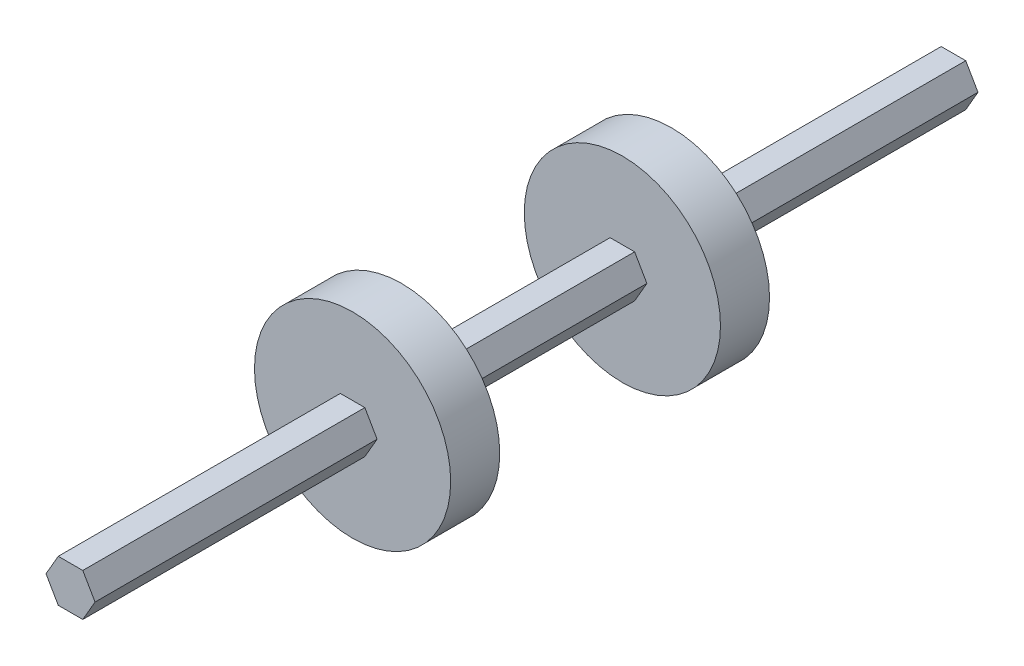
ISO-10303-21;
HEADER;
FILE_DESCRIPTION(('STEP AP214'),'2;1');
FILE_NAME('part.step','',(''),(''),'','','');
FILE_SCHEMA(('AUTOMOTIVE_DESIGN { 1 0 10303 214 1 1 1 1 }'));
ENDSEC;
DATA;
#1=APPLICATION_CONTEXT('core data for automotive mechanical design processes');
#2=APPLICATION_PROTOCOL_DEFINITION('international standard','automotive_design',2000,#1);
#3=PRODUCT_CONTEXT('',#1,'mechanical');
#4=PRODUCT('Part','Part','',(#3));
#5=PRODUCT_RELATED_PRODUCT_CATEGORY('part','',(#4));
#6=PRODUCT_DEFINITION_FORMATION('','',#4);
#7=PRODUCT_DEFINITION_CONTEXT('part definition',#1,'design');
#8=PRODUCT_DEFINITION('design','',#6,#7);
#9=PRODUCT_DEFINITION_SHAPE('','',#8);
#10=(LENGTH_UNIT() NAMED_UNIT(*) SI_UNIT(.MILLI.,.METRE.));
#11=(NAMED_UNIT(*) PLANE_ANGLE_UNIT() SI_UNIT($,.RADIAN.));
#12=(NAMED_UNIT(*) SI_UNIT($,.STERADIAN.) SOLID_ANGLE_UNIT());
#13=UNCERTAINTY_MEASURE_WITH_UNIT(LENGTH_MEASURE(1.E-05),#10,'distance_accuracy_value','');
#14=(GEOMETRIC_REPRESENTATION_CONTEXT(3) GLOBAL_UNCERTAINTY_ASSIGNED_CONTEXT((#13)) GLOBAL_UNIT_ASSIGNED_CONTEXT((#10,
#11,#12)) REPRESENTATION_CONTEXT('',''));
#15=CARTESIAN_POINT('',(0.,0.,0.));
#16=DIRECTION('',(0.,0.,1.));
#17=DIRECTION('',(1.,0.,0.));
#18=AXIS2_PLACEMENT_3D('',#15,#16,#17);
#19=CARTESIAN_POINT('',(6.35,0.,228.6));
#20=DIRECTION('',(-0.866025403784439,-0.5,0.));
#21=DIRECTION('',(0.5,-0.866025403784439,0.));
#22=AXIS2_PLACEMENT_3D('',#19,#20,#21);
#23=PLANE('',#22);
#24=DIRECTION('',(-0.5,0.866025403784439,0.));
#25=VECTOR('',#24,1.);
#26=CARTESIAN_POINT('',(6.35,0.,142.875));
#27=LINE('',#26,#25);
#28=CARTESIAN_POINT('',(6.35,0.,142.875));
#29=VERTEX_POINT('',#28);
#30=CARTESIAN_POINT('',(3.175,5.49926131403119,142.875));
#31=VERTEX_POINT('',#30);
#32=EDGE_CURVE('E58',#29,#31,#27,.T.);
#33=ORIENTED_EDGE('',*,*,#32,.F.);
#34=DIRECTION('',(0.,0.,-1.));
#35=VECTOR('',#34,1.);
#36=CARTESIAN_POINT('',(6.35,0.,228.6));
#37=LINE('',#36,#35);
#38=CARTESIAN_POINT('',(6.35,0.,85.725));
#39=VERTEX_POINT('',#38);
#40=EDGE_CURVE('E216',#29,#39,#37,.T.);
#41=ORIENTED_EDGE('',*,*,#40,.T.);
#42=DIRECTION('',(-0.5,0.866025403784439,0.));
#43=VECTOR('',#42,1.);
#44=CARTESIAN_POINT('',(6.35,0.,85.725));
#45=LINE('',#44,#43);
#46=CARTESIAN_POINT('',(3.175,5.49926131403119,85.725));
#47=VERTEX_POINT('',#46);
#48=EDGE_CURVE('E193',#39,#47,#45,.T.);
#49=ORIENTED_EDGE('',*,*,#48,.T.);
#50=DIRECTION('',(0.,0.,-1.));
#51=VECTOR('',#50,1.);
#52=CARTESIAN_POINT('',(3.175,5.49926131403119,228.6));
#53=LINE('',#52,#51);
#54=EDGE_CURVE('E221',#31,#47,#53,.T.);
#55=ORIENTED_EDGE('',*,*,#54,.F.);
#56=EDGE_LOOP('',(#33,#41,#49,#55));
#57=FACE_BOUND('',#56,.T.);
#58=ADVANCED_FACE('F43',(#57),#23,.F.);
#59=CARTESIAN_POINT('',(3.175,-5.49926131403119,228.6));
#60=DIRECTION('',(-0.866025403784439,0.5,0.));
#61=DIRECTION('',(-0.5,-0.866025403784439,0.));
#62=AXIS2_PLACEMENT_3D('',#59,#60,#61);
#63=PLANE('',#62);
#64=DIRECTION('',(0.5,0.866025403784439,0.));
#65=VECTOR('',#64,1.);
#66=CARTESIAN_POINT('',(3.175,-5.49926131403119,142.875));
#67=LINE('',#66,#65);
#68=CARTESIAN_POINT('',(3.175,-5.49926131403119,142.875));
#69=VERTEX_POINT('',#68);
#70=EDGE_CURVE('E65',#69,#29,#67,.T.);
#71=ORIENTED_EDGE('',*,*,#70,.F.);
#72=DIRECTION('',(0.,0.,-1.));
#73=VECTOR('',#72,1.);
#74=CARTESIAN_POINT('',(3.175,-5.49926131403119,228.6));
#75=LINE('',#74,#73);
#76=CARTESIAN_POINT('',(3.175,-5.49926131403119,85.725));
#77=VERTEX_POINT('',#76);
#78=EDGE_CURVE('E211',#69,#77,#75,.T.);
#79=ORIENTED_EDGE('',*,*,#78,.T.);
#80=DIRECTION('',(0.5,0.866025403784439,0.));
#81=VECTOR('',#80,1.);
#82=CARTESIAN_POINT('',(3.175,-5.49926131403119,85.725));
#83=LINE('',#82,#81);
#84=EDGE_CURVE('E278',#77,#39,#83,.T.);
#85=ORIENTED_EDGE('',*,*,#84,.T.);
#86=ORIENTED_EDGE('',*,*,#40,.F.);
#87=EDGE_LOOP('',(#71,#79,#85,#86));
#88=FACE_BOUND('',#87,.T.);
#89=ADVANCED_FACE('F332',(#88),#63,.F.);
#90=CARTESIAN_POINT('',(-3.175,-5.49926131403118,228.6));
#91=DIRECTION('',(0.,1.,0.));
#92=DIRECTION('',(-1.,0.,0.));
#93=AXIS2_PLACEMENT_3D('',#90,#91,#92);
#94=PLANE('',#93);
#95=DIRECTION('',(1.,0.,0.));
#96=VECTOR('',#95,1.);
#97=CARTESIAN_POINT('',(-3.175,-5.49926131403118,142.875));
#98=LINE('',#97,#96);
#99=CARTESIAN_POINT('',(-3.175,-5.49926131403118,142.875));
#100=VERTEX_POINT('',#99);
#101=EDGE_CURVE('E304',#100,#69,#98,.T.);
#102=ORIENTED_EDGE('',*,*,#101,.F.);
#103=DIRECTION('',(0.,0.,-1.));
#104=VECTOR('',#103,1.);
#105=CARTESIAN_POINT('',(-3.175,-5.49926131403118,228.6));
#106=LINE('',#105,#104);
#107=CARTESIAN_POINT('',(-3.175,-5.49926131403118,85.725));
#108=VERTEX_POINT('',#107);
#109=EDGE_CURVE('E206',#100,#108,#106,.T.);
#110=ORIENTED_EDGE('',*,*,#109,.T.);
#111=DIRECTION('',(1.,0.,0.));
#112=VECTOR('',#111,1.);
#113=CARTESIAN_POINT('',(-3.175,-5.49926131403118,85.725));
#114=LINE('',#113,#112);
#115=EDGE_CURVE('E275',#108,#77,#114,.T.);
#116=ORIENTED_EDGE('',*,*,#115,.T.);
#117=ORIENTED_EDGE('',*,*,#78,.F.);
#118=EDGE_LOOP('',(#102,#110,#116,#117));
#119=FACE_BOUND('',#118,.T.);
#120=ADVANCED_FACE('F340',(#119),#94,.F.);
#121=CARTESIAN_POINT('',(-6.35,0.,228.6));
#122=DIRECTION('',(0.866025403784439,0.5,0.));
#123=DIRECTION('',(-0.5,0.866025403784439,0.));
#124=AXIS2_PLACEMENT_3D('',#121,#122,#123);
#125=PLANE('',#124);
#126=DIRECTION('',(0.5,-0.866025403784439,0.));
#127=VECTOR('',#126,1.);
#128=CARTESIAN_POINT('',(-6.35,0.,142.875));
#129=LINE('',#128,#127);
#130=CARTESIAN_POINT('',(-6.35,0.,142.875));
#131=VERTEX_POINT('',#130);
#132=EDGE_CURVE('E187',#131,#100,#129,.T.);
#133=ORIENTED_EDGE('',*,*,#132,.F.);
#134=DIRECTION('',(0.,0.,-1.));
#135=VECTOR('',#134,1.);
#136=CARTESIAN_POINT('',(-6.35,0.,228.6));
#137=LINE('',#136,#135);
#138=CARTESIAN_POINT('',(-6.35,0.,85.725));
#139=VERTEX_POINT('',#138);
#140=EDGE_CURVE('E184',#131,#139,#137,.T.);
#141=ORIENTED_EDGE('',*,*,#140,.T.);
#142=DIRECTION('',(0.5,-0.866025403784439,0.));
#143=VECTOR('',#142,1.);
#144=CARTESIAN_POINT('',(-6.35,0.,85.725));
#145=LINE('',#144,#143);
#146=EDGE_CURVE('E272',#139,#108,#145,.T.);
#147=ORIENTED_EDGE('',*,*,#146,.T.);
#148=ORIENTED_EDGE('',*,*,#109,.F.);
#149=EDGE_LOOP('',(#133,#141,#147,#148));
#150=FACE_BOUND('',#149,.T.);
#151=ADVANCED_FACE('F417',(#150),#125,.F.);
#152=CARTESIAN_POINT('',(-3.175,5.49926131403119,228.6));
#153=DIRECTION('',(0.866025403784439,-0.5,0.));
#154=DIRECTION('',(0.5,0.866025403784439,0.));
#155=AXIS2_PLACEMENT_3D('',#152,#153,#154);
#156=PLANE('',#155);
#157=DIRECTION('',(-0.5,-0.866025403784439,0.));
#158=VECTOR('',#157,1.);
#159=CARTESIAN_POINT('',(-3.175,5.49926131403119,142.875));
#160=LINE('',#159,#158);
#161=CARTESIAN_POINT('',(-3.175,5.49926131403119,142.875));
#162=VERTEX_POINT('',#161);
#163=EDGE_CURVE('E182',#162,#131,#160,.T.);
#164=ORIENTED_EDGE('',*,*,#163,.F.);
#165=DIRECTION('',(0.,0.,-1.));
#166=VECTOR('',#165,1.);
#167=CARTESIAN_POINT('',(-3.175,5.49926131403119,228.6));
#168=LINE('',#167,#166);
#169=CARTESIAN_POINT('',(-3.175,5.49926131403119,85.725));
#170=VERTEX_POINT('',#169);
#171=EDGE_CURVE('E168',#162,#170,#168,.T.);
#172=ORIENTED_EDGE('',*,*,#171,.T.);
#173=DIRECTION('',(-0.5,-0.866025403784439,0.));
#174=VECTOR('',#173,1.);
#175=CARTESIAN_POINT('',(-3.175,5.49926131403119,85.725));
#176=LINE('',#175,#174);
#177=EDGE_CURVE('E270',#170,#139,#176,.T.);
#178=ORIENTED_EDGE('',*,*,#177,.T.);
#179=ORIENTED_EDGE('',*,*,#140,.F.);
#180=EDGE_LOOP('',(#164,#172,#178,#179));
#181=FACE_BOUND('',#180,.T.);
#182=ADVANCED_FACE('F183',(#181),#156,.F.);
#183=CARTESIAN_POINT('',(3.175,5.49926131403119,228.6));
#184=DIRECTION('',(0.,-1.,0.));
#185=DIRECTION('',(0.,0.,-1.));
#186=AXIS2_PLACEMENT_3D('',#183,#184,#185);
#187=PLANE('',#186);
#188=DIRECTION('',(-1.,0.,0.));
#189=VECTOR('',#188,1.);
#190=CARTESIAN_POINT('',(3.175,5.49926131403119,142.875));
#191=LINE('',#190,#189);
#192=EDGE_CURVE('E51',#31,#162,#191,.T.);
#193=ORIENTED_EDGE('',*,*,#192,.F.);
#194=ORIENTED_EDGE('',*,*,#54,.T.);
#195=DIRECTION('',(-1.,0.,0.));
#196=VECTOR('',#195,1.);
#197=CARTESIAN_POINT('',(3.175,5.49926131403119,85.725));
#198=LINE('',#197,#196);
#199=EDGE_CURVE('E173',#47,#170,#198,.T.);
#200=ORIENTED_EDGE('',*,*,#199,.T.);
#201=ORIENTED_EDGE('',*,*,#171,.F.);
#202=EDGE_LOOP('',(#193,#194,#200,#201));
#203=FACE_BOUND('',#202,.T.);
#204=ADVANCED_FACE('F170',(#203),#187,.F.);
#205=DIRECTION('',(-1.,0.,0.));
#206=VECTOR('',#205,1.);
#207=CARTESIAN_POINT('',(3.175,5.49926131403119,73.025));
#208=LINE('',#207,#206);
#209=CARTESIAN_POINT('',(3.175,5.49926131403118,73.025));
#210=VERTEX_POINT('',#209);
#211=CARTESIAN_POINT('',(-3.175,5.49926131403119,73.025));
#212=VERTEX_POINT('',#211);
#213=EDGE_CURVE('E242',#210,#212,#208,.T.);
#214=ORIENTED_EDGE('',*,*,#213,.F.);
#215=CARTESIAN_POINT('',(3.175,5.49926131403119,0.));
#216=VERTEX_POINT('',#215);
#217=EDGE_CURVE('E222',#210,#216,#53,.T.);
#218=ORIENTED_EDGE('',*,*,#217,.T.);
#219=DIRECTION('',(-1.,0.,0.));
#220=VECTOR('',#219,1.);
#221=CARTESIAN_POINT('',(3.175,5.49926131403119,0.));
#222=LINE('',#221,#220);
#223=CARTESIAN_POINT('',(-3.175,5.49926131403119,0.));
#224=VERTEX_POINT('',#223);
#225=EDGE_CURVE('E239',#216,#224,#222,.T.);
#226=ORIENTED_EDGE('',*,*,#225,.T.);
#227=EDGE_CURVE('E178',#212,#224,#168,.T.);
#228=ORIENTED_EDGE('',*,*,#227,.F.);
#229=EDGE_LOOP('',(#214,#218,#226,#228));
#230=FACE_BOUND('',#229,.T.);
#231=ADVANCED_FACE('F379',(#230),#187,.F.);
#232=DIRECTION('',(-0.5,-0.866025403784439,0.));
#233=VECTOR('',#232,1.);
#234=CARTESIAN_POINT('',(-3.175,5.49926131403119,73.025));
#235=LINE('',#234,#233);
#236=CARTESIAN_POINT('',(-6.35,0.,73.025));
#237=VERTEX_POINT('',#236);
#238=EDGE_CURVE('E257',#212,#237,#235,.T.);
#239=ORIENTED_EDGE('',*,*,#238,.F.);
#240=ORIENTED_EDGE('',*,*,#227,.T.);
#241=DIRECTION('',(-0.5,-0.866025403784439,0.));
#242=VECTOR('',#241,1.);
#243=CARTESIAN_POINT('',(-3.175,5.49926131403119,0.));
#244=LINE('',#243,#242);
#245=CARTESIAN_POINT('',(-6.35,0.,0.));
#246=VERTEX_POINT('',#245);
#247=EDGE_CURVE('E236',#224,#246,#244,.T.);
#248=ORIENTED_EDGE('',*,*,#247,.T.);
#249=EDGE_CURVE('E202',#237,#246,#137,.T.);
#250=ORIENTED_EDGE('',*,*,#249,.F.);
#251=EDGE_LOOP('',(#239,#240,#248,#250));
#252=FACE_BOUND('',#251,.T.);
#253=ADVANCED_FACE('F410',(#252),#156,.F.);
#254=DIRECTION('',(0.5,-0.866025403784439,0.));
#255=VECTOR('',#254,1.);
#256=CARTESIAN_POINT('',(-6.35,0.,73.025));
#257=LINE('',#256,#255);
#258=CARTESIAN_POINT('',(-3.175,-5.49926131403118,73.025));
#259=VERTEX_POINT('',#258);
#260=EDGE_CURVE('E260',#237,#259,#257,.T.);
#261=ORIENTED_EDGE('',*,*,#260,.F.);
#262=ORIENTED_EDGE('',*,*,#249,.T.);
#263=DIRECTION('',(0.5,-0.866025403784439,0.));
#264=VECTOR('',#263,1.);
#265=CARTESIAN_POINT('',(-6.35,0.,0.));
#266=LINE('',#265,#264);
#267=CARTESIAN_POINT('',(-3.175,-5.49926131403118,0.));
#268=VERTEX_POINT('',#267);
#269=EDGE_CURVE('E233',#246,#268,#266,.T.);
#270=ORIENTED_EDGE('',*,*,#269,.T.);
#271=EDGE_CURVE('E207',#259,#268,#106,.T.);
#272=ORIENTED_EDGE('',*,*,#271,.F.);
#273=EDGE_LOOP('',(#261,#262,#270,#272));
#274=FACE_BOUND('',#273,.T.);
#275=ADVANCED_FACE('F407',(#274),#125,.F.);
#276=DIRECTION('',(1.,0.,0.));
#277=VECTOR('',#276,1.);
#278=CARTESIAN_POINT('',(-3.175,-5.49926131403118,73.025));
#279=LINE('',#278,#277);
#280=CARTESIAN_POINT('',(3.175,-5.49926131403119,73.025));
#281=VERTEX_POINT('',#280);
#282=EDGE_CURVE('E263',#259,#281,#279,.T.);
#283=ORIENTED_EDGE('',*,*,#282,.F.);
#284=ORIENTED_EDGE('',*,*,#271,.T.);
#285=DIRECTION('',(1.,0.,0.));
#286=VECTOR('',#285,1.);
#287=CARTESIAN_POINT('',(-3.175,-5.49926131403118,0.));
#288=LINE('',#287,#286);
#289=CARTESIAN_POINT('',(3.175,-5.49926131403119,0.));
#290=VERTEX_POINT('',#289);
#291=EDGE_CURVE('E230',#268,#290,#288,.T.);
#292=ORIENTED_EDGE('',*,*,#291,.T.);
#293=EDGE_CURVE('E212',#281,#290,#75,.T.);
#294=ORIENTED_EDGE('',*,*,#293,.F.);
#295=EDGE_LOOP('',(#283,#284,#292,#294));
#296=FACE_BOUND('',#295,.T.);
#297=ADVANCED_FACE('F404',(#296),#94,.F.);
#298=DIRECTION('',(0.5,0.866025403784439,0.));
#299=VECTOR('',#298,1.);
#300=CARTESIAN_POINT('',(3.175,-5.49926131403119,73.025));
#301=LINE('',#300,#299);
#302=CARTESIAN_POINT('',(6.35,0.,73.025));
#303=VERTEX_POINT('',#302);
#304=EDGE_CURVE('E266',#281,#303,#301,.T.);
#305=ORIENTED_EDGE('',*,*,#304,.F.);
#306=ORIENTED_EDGE('',*,*,#293,.T.);
#307=DIRECTION('',(0.5,0.866025403784439,0.));
#308=VECTOR('',#307,1.);
#309=CARTESIAN_POINT('',(3.175,-5.49926131403119,0.));
#310=LINE('',#309,#308);
#311=CARTESIAN_POINT('',(6.35,0.,0.));
#312=VERTEX_POINT('',#311);
#313=EDGE_CURVE('E227',#290,#312,#310,.T.);
#314=ORIENTED_EDGE('',*,*,#313,.T.);
#315=EDGE_CURVE('E217',#303,#312,#37,.T.);
#316=ORIENTED_EDGE('',*,*,#315,.F.);
#317=EDGE_LOOP('',(#305,#306,#314,#316));
#318=FACE_BOUND('',#317,.T.);
#319=ADVANCED_FACE('F342',(#318),#63,.F.);
#320=DIRECTION('',(-0.5,0.866025403784439,0.));
#321=VECTOR('',#320,1.);
#322=CARTESIAN_POINT('',(6.35,0.,73.025));
#323=LINE('',#322,#321);
#324=EDGE_CURVE('E191',#303,#210,#323,.T.);
#325=ORIENTED_EDGE('',*,*,#324,.F.);
#326=ORIENTED_EDGE('',*,*,#315,.T.);
#327=DIRECTION('',(-0.5,0.866025403784439,0.));
#328=VECTOR('',#327,1.);
#329=CARTESIAN_POINT('',(6.35,0.,0.));
#330=LINE('',#329,#328);
#331=EDGE_CURVE('E223',#312,#216,#330,.T.);
#332=ORIENTED_EDGE('',*,*,#331,.T.);
#333=ORIENTED_EDGE('',*,*,#217,.F.);
#334=EDGE_LOOP('',(#325,#326,#332,#333));
#335=FACE_BOUND('',#334,.T.);
#336=ADVANCED_FACE('F334',(#335),#23,.F.);
#337=CARTESIAN_POINT('',(0.,0.,0.));
#338=DIRECTION('',(0.,0.,1.));
#339=DIRECTION('',(1.,0.,0.));
#340=AXIS2_PLACEMENT_3D('',#337,#338,#339);
#341=PLANE('',#340);
#342=ORIENTED_EDGE('',*,*,#225,.F.);
#343=ORIENTED_EDGE('',*,*,#331,.F.);
#344=ORIENTED_EDGE('',*,*,#313,.F.);
#345=ORIENTED_EDGE('',*,*,#291,.F.);
#346=ORIENTED_EDGE('',*,*,#269,.F.);
#347=ORIENTED_EDGE('',*,*,#247,.F.);
#348=EDGE_LOOP('',(#342,#343,#344,#345,#346,#347));
#349=FACE_BOUND('',#348,.T.);
#350=ADVANCED_FACE('F346',(#349),#341,.F.);
#351=CARTESIAN_POINT('',(0.,0.,73.025));
#352=DIRECTION('',(0.,0.,1.));
#353=DIRECTION('',(1.,0.,0.));
#354=AXIS2_PLACEMENT_3D('',#351,#352,#353);
#355=PLANE('',#354);
#356=CARTESIAN_POINT('',(0.,0.,73.025));
#357=DIRECTION('',(0.,0.,1.));
#358=DIRECTION('',(1.,0.,0.));
#359=AXIS2_PLACEMENT_3D('',#356,#357,#358);
#360=CIRCLE('',#359,25.4);
#361=CARTESIAN_POINT('',(25.4,0.,73.025));
#362=VERTEX_POINT('',#361);
#363=EDGE_CURVE('E281',#362,#362,#360,.T.);
#364=ORIENTED_EDGE('',*,*,#363,.F.);
#365=EDGE_LOOP('',(#364));
#366=FACE_BOUND('',#365,.T.);
#367=ORIENTED_EDGE('',*,*,#324,.T.);
#368=ORIENTED_EDGE('',*,*,#213,.T.);
#369=ORIENTED_EDGE('',*,*,#238,.T.);
#370=ORIENTED_EDGE('',*,*,#260,.T.);
#371=ORIENTED_EDGE('',*,*,#282,.T.);
#372=ORIENTED_EDGE('',*,*,#304,.T.);
#373=EDGE_LOOP('',(#367,#368,#369,#370,#371,#372));
#374=FACE_BOUND('',#373,.T.);
#375=ADVANCED_FACE('F382',(#366,#374),#355,.F.);
#376=CARTESIAN_POINT('',(0.,0.,85.725));
#377=DIRECTION('',(0.,0.,1.));
#378=DIRECTION('',(1.,0.,0.));
#379=AXIS2_PLACEMENT_3D('',#376,#377,#378);
#380=PLANE('',#379);
#381=CARTESIAN_POINT('',(0.,0.,85.725));
#382=DIRECTION('',(0.,0.,1.));
#383=DIRECTION('',(1.,0.,0.));
#384=AXIS2_PLACEMENT_3D('',#381,#382,#383);
#385=CIRCLE('',#384,25.4);
#386=CARTESIAN_POINT('',(25.4,0.,85.725));
#387=VERTEX_POINT('',#386);
#388=EDGE_CURVE('E282',#387,#387,#385,.T.);
#389=ORIENTED_EDGE('',*,*,#388,.T.);
#390=EDGE_LOOP('',(#389));
#391=FACE_BOUND('',#390,.T.);
#392=ORIENTED_EDGE('',*,*,#199,.F.);
#393=ORIENTED_EDGE('',*,*,#48,.F.);
#394=ORIENTED_EDGE('',*,*,#84,.F.);
#395=ORIENTED_EDGE('',*,*,#115,.F.);
#396=ORIENTED_EDGE('',*,*,#146,.F.);
#397=ORIENTED_EDGE('',*,*,#177,.F.);
#398=EDGE_LOOP('',(#392,#393,#394,#395,#396,#397));
#399=FACE_BOUND('',#398,.T.);
#400=ADVANCED_FACE('F388',(#391,#399),#380,.T.);
#401=CARTESIAN_POINT('',(0.,0.,73.025));
#402=DIRECTION('',(0.,0.,1.));
#403=DIRECTION('',(1.,0.,0.));
#404=AXIS2_PLACEMENT_3D('',#401,#402,#403);
#405=CYLINDRICAL_SURFACE('',#404,25.4);
#406=ORIENTED_EDGE('',*,*,#363,.T.);
#407=EDGE_LOOP('',(#406));
#408=FACE_BOUND('',#407,.T.);
#409=ORIENTED_EDGE('',*,*,#388,.F.);
#410=EDGE_LOOP('',(#409));
#411=FACE_BOUND('',#410,.T.);
#412=ADVANCED_FACE('F329',(#408,#411),#405,.T.);
#413=CARTESIAN_POINT('',(0.,0.,155.575));
#414=DIRECTION('',(0.,0.,1.));
#415=DIRECTION('',(1.,0.,0.));
#416=AXIS2_PLACEMENT_3D('',#413,#414,#415);
#417=PLANE('',#416);
#418=CARTESIAN_POINT('',(0.,0.,155.575));
#419=DIRECTION('',(0.,0.,1.));
#420=DIRECTION('',(1.,0.,0.));
#421=AXIS2_PLACEMENT_3D('',#418,#419,#420);
#422=CIRCLE('',#421,25.4);
#423=CARTESIAN_POINT('',(25.4,0.,155.575));
#424=VERTEX_POINT('',#423);
#425=EDGE_CURVE('E188',#424,#424,#422,.T.);
#426=ORIENTED_EDGE('',*,*,#425,.T.);
#427=EDGE_LOOP('',(#426));
#428=FACE_BOUND('',#427,.T.);
#429=DIRECTION('',(-0.5,0.866025403784439,0.));
#430=VECTOR('',#429,1.);
#431=CARTESIAN_POINT('',(6.35,0.,155.575));
#432=LINE('',#431,#430);
#433=CARTESIAN_POINT('',(6.35,0.,155.575));
#434=VERTEX_POINT('',#433);
#435=CARTESIAN_POINT('',(3.175,5.49926131403119,155.575));
#436=VERTEX_POINT('',#435);
#437=EDGE_CURVE('E285',#434,#436,#432,.T.);
#438=ORIENTED_EDGE('',*,*,#437,.F.);
#439=DIRECTION('',(0.5,0.866025403784439,0.));
#440=VECTOR('',#439,1.);
#441=CARTESIAN_POINT('',(3.175,-5.49926131403119,155.575));
#442=LINE('',#441,#440);
#443=CARTESIAN_POINT('',(3.175,-5.49926131403119,155.575));
#444=VERTEX_POINT('',#443);
#445=EDGE_CURVE('E290',#444,#434,#442,.T.);
#446=ORIENTED_EDGE('',*,*,#445,.F.);
#447=DIRECTION('',(1.,0.,0.));
#448=VECTOR('',#447,1.);
#449=CARTESIAN_POINT('',(-3.175,-5.49926131403118,155.575));
#450=LINE('',#449,#448);
#451=CARTESIAN_POINT('',(-3.175,-5.49926131403118,155.575));
#452=VERTEX_POINT('',#451);
#453=EDGE_CURVE('E293',#452,#444,#450,.T.);
#454=ORIENTED_EDGE('',*,*,#453,.F.);
#455=DIRECTION('',(0.5,-0.866025403784439,0.));
#456=VECTOR('',#455,1.);
#457=CARTESIAN_POINT('',(-6.35,0.,155.575));
#458=LINE('',#457,#456);
#459=CARTESIAN_POINT('',(-6.35,0.,155.575));
#460=VERTEX_POINT('',#459);
#461=EDGE_CURVE('E296',#460,#452,#458,.T.);
#462=ORIENTED_EDGE('',*,*,#461,.F.);
#463=DIRECTION('',(-0.5,-0.866025403784439,0.));
#464=VECTOR('',#463,1.);
#465=CARTESIAN_POINT('',(-3.175,5.49926131403119,155.575));
#466=LINE('',#465,#464);
#467=CARTESIAN_POINT('',(-3.175,5.49926131403119,155.575));
#468=VERTEX_POINT('',#467);
#469=EDGE_CURVE('E299',#468,#460,#466,.T.);
#470=ORIENTED_EDGE('',*,*,#469,.F.);
#471=DIRECTION('',(-1.,0.,0.));
#472=VECTOR('',#471,1.);
#473=CARTESIAN_POINT('',(3.175,5.49926131403119,155.575));
#474=LINE('',#473,#472);
#475=EDGE_CURVE('E11',#436,#468,#474,.T.);
#476=ORIENTED_EDGE('',*,*,#475,.F.);
#477=EDGE_LOOP('',(#438,#446,#454,#462,#470,#476));
#478=FACE_BOUND('',#477,.T.);
#479=ADVANCED_FACE('F314',(#428,#478),#417,.T.);
#480=CARTESIAN_POINT('',(0.,0.,142.875));
#481=DIRECTION('',(0.,0.,1.));
#482=DIRECTION('',(1.,0.,0.));
#483=AXIS2_PLACEMENT_3D('',#480,#481,#482);
#484=PLANE('',#483);
#485=CARTESIAN_POINT('',(0.,0.,142.875));
#486=DIRECTION('',(0.,0.,1.));
#487=DIRECTION('',(1.,0.,0.));
#488=AXIS2_PLACEMENT_3D('',#485,#486,#487);
#489=CIRCLE('',#488,25.4);
#490=CARTESIAN_POINT('',(25.4,0.,142.875));
#491=VERTEX_POINT('',#490);
#492=EDGE_CURVE('E308',#491,#491,#489,.T.);
#493=ORIENTED_EDGE('',*,*,#492,.F.);
#494=EDGE_LOOP('',(#493));
#495=FACE_BOUND('',#494,.T.);
#496=ORIENTED_EDGE('',*,*,#70,.T.);
#497=ORIENTED_EDGE('',*,*,#32,.T.);
#498=ORIENTED_EDGE('',*,*,#192,.T.);
#499=ORIENTED_EDGE('',*,*,#163,.T.);
#500=ORIENTED_EDGE('',*,*,#132,.T.);
#501=ORIENTED_EDGE('',*,*,#101,.T.);
#502=EDGE_LOOP('',(#496,#497,#498,#499,#500,#501));
#503=FACE_BOUND('',#502,.T.);
#504=ADVANCED_FACE('F190',(#495,#503),#484,.F.);
#505=CARTESIAN_POINT('',(0.,0.,155.575));
#506=DIRECTION('',(0.,0.,-1.));
#507=DIRECTION('',(-1.,0.,0.));
#508=AXIS2_PLACEMENT_3D('',#505,#506,#507);
#509=CYLINDRICAL_SURFACE('',#508,25.4);
#510=ORIENTED_EDGE('',*,*,#425,.F.);
#511=EDGE_LOOP('',(#510));
#512=FACE_BOUND('',#511,.T.);
#513=ORIENTED_EDGE('',*,*,#492,.T.);
#514=EDGE_LOOP('',(#513));
#515=FACE_BOUND('',#514,.T.);
#516=ADVANCED_FACE('F317',(#512,#515),#509,.T.);
#517=CARTESIAN_POINT('',(0.,0.,228.6));
#518=DIRECTION('',(0.,0.,1.));
#519=DIRECTION('',(1.,0.,0.));
#520=AXIS2_PLACEMENT_3D('',#517,#518,#519);
#521=PLANE('',#520);
#522=DIRECTION('',(-1.,0.,0.));
#523=VECTOR('',#522,1.);
#524=CARTESIAN_POINT('',(3.175,5.49926131403119,228.6));
#525=LINE('',#524,#523);
#526=CARTESIAN_POINT('',(3.175,5.49926131403119,228.6));
#527=VERTEX_POINT('',#526);
#528=CARTESIAN_POINT('',(-3.175,5.49926131403119,228.6));
#529=VERTEX_POINT('',#528);
#530=EDGE_CURVE('E226',#527,#529,#525,.T.);
#531=ORIENTED_EDGE('',*,*,#530,.T.);
#532=DIRECTION('',(-0.5,-0.866025403784439,0.));
#533=VECTOR('',#532,1.);
#534=CARTESIAN_POINT('',(-3.175,5.49926131403119,228.6));
#535=LINE('',#534,#533);
#536=CARTESIAN_POINT('',(-6.35,0.,228.6));
#537=VERTEX_POINT('',#536);
#538=EDGE_CURVE('E251',#529,#537,#535,.T.);
#539=ORIENTED_EDGE('',*,*,#538,.T.);
#540=DIRECTION('',(0.5,-0.866025403784439,0.));
#541=VECTOR('',#540,1.);
#542=CARTESIAN_POINT('',(-6.35,0.,228.6));
#543=LINE('',#542,#541);
#544=CARTESIAN_POINT('',(-3.175,-5.49926131403118,228.6));
#545=VERTEX_POINT('',#544);
#546=EDGE_CURVE('E249',#537,#545,#543,.T.);
#547=ORIENTED_EDGE('',*,*,#546,.T.);
#548=DIRECTION('',(1.,0.,0.));
#549=VECTOR('',#548,1.);
#550=CARTESIAN_POINT('',(-3.175,-5.49926131403118,228.6));
#551=LINE('',#550,#549);
#552=CARTESIAN_POINT('',(3.175,-5.49926131403119,228.6));
#553=VERTEX_POINT('',#552);
#554=EDGE_CURVE('E247',#545,#553,#551,.T.);
#555=ORIENTED_EDGE('',*,*,#554,.T.);
#556=DIRECTION('',(0.5,0.866025403784439,0.));
#557=VECTOR('',#556,1.);
#558=CARTESIAN_POINT('',(3.175,-5.49926131403119,228.6));
#559=LINE('',#558,#557);
#560=CARTESIAN_POINT('',(6.35,0.,228.6));
#561=VERTEX_POINT('',#560);
#562=EDGE_CURVE('E245',#553,#561,#559,.T.);
#563=ORIENTED_EDGE('',*,*,#562,.T.);
#564=DIRECTION('',(-0.5,0.866025403784439,0.));
#565=VECTOR('',#564,1.);
#566=CARTESIAN_POINT('',(6.35,0.,228.6));
#567=LINE('',#566,#565);
#568=EDGE_CURVE('E243',#561,#527,#567,.T.);
#569=ORIENTED_EDGE('',*,*,#568,.T.);
#570=EDGE_LOOP('',(#531,#539,#547,#555,#563,#569));
#571=FACE_BOUND('',#570,.T.);
#572=ADVANCED_FACE('F320',(#571),#521,.T.);
#573=EDGE_CURVE('E218',#527,#436,#53,.T.);
#574=ORIENTED_EDGE('',*,*,#573,.T.);
#575=ORIENTED_EDGE('',*,*,#475,.T.);
#576=EDGE_CURVE('E177',#529,#468,#168,.T.);
#577=ORIENTED_EDGE('',*,*,#576,.F.);
#578=ORIENTED_EDGE('',*,*,#530,.F.);
#579=EDGE_LOOP('',(#574,#575,#577,#578));
#580=FACE_BOUND('',#579,.T.);
#581=ADVANCED_FACE('F45',(#580),#187,.F.);
#582=ORIENTED_EDGE('',*,*,#576,.T.);
#583=ORIENTED_EDGE('',*,*,#469,.T.);
#584=EDGE_CURVE('E199',#537,#460,#137,.T.);
#585=ORIENTED_EDGE('',*,*,#584,.F.);
#586=ORIENTED_EDGE('',*,*,#538,.F.);
#587=EDGE_LOOP('',(#582,#583,#585,#586));
#588=FACE_BOUND('',#587,.T.);
#589=ADVANCED_FACE('F368',(#588),#156,.F.);
#590=ORIENTED_EDGE('',*,*,#584,.T.);
#591=ORIENTED_EDGE('',*,*,#461,.T.);
#592=EDGE_CURVE('E203',#545,#452,#106,.T.);
#593=ORIENTED_EDGE('',*,*,#592,.F.);
#594=ORIENTED_EDGE('',*,*,#546,.F.);
#595=EDGE_LOOP('',(#590,#591,#593,#594));
#596=FACE_BOUND('',#595,.T.);
#597=ADVANCED_FACE('F365',(#596),#125,.F.);
#598=ORIENTED_EDGE('',*,*,#592,.T.);
#599=ORIENTED_EDGE('',*,*,#453,.T.);
#600=EDGE_CURVE('E208',#553,#444,#75,.T.);
#601=ORIENTED_EDGE('',*,*,#600,.F.);
#602=ORIENTED_EDGE('',*,*,#554,.F.);
#603=EDGE_LOOP('',(#598,#599,#601,#602));
#604=FACE_BOUND('',#603,.T.);
#605=ADVANCED_FACE('F353',(#604),#94,.F.);
#606=ORIENTED_EDGE('',*,*,#600,.T.);
#607=ORIENTED_EDGE('',*,*,#445,.T.);
#608=EDGE_CURVE('E213',#561,#434,#37,.T.);
#609=ORIENTED_EDGE('',*,*,#608,.F.);
#610=ORIENTED_EDGE('',*,*,#562,.F.);
#611=EDGE_LOOP('',(#606,#607,#609,#610));
#612=FACE_BOUND('',#611,.T.);
#613=ADVANCED_FACE('F343',(#612),#63,.F.);
#614=ORIENTED_EDGE('',*,*,#608,.T.);
#615=ORIENTED_EDGE('',*,*,#437,.T.);
#616=ORIENTED_EDGE('',*,*,#573,.F.);
#617=ORIENTED_EDGE('',*,*,#568,.F.);
#618=EDGE_LOOP('',(#614,#615,#616,#617));
#619=FACE_BOUND('',#618,.T.);
#620=ADVANCED_FACE('F335',(#619),#23,.F.);
#621=CLOSED_SHELL('',(#58,#89,#120,#151,#182,#204,#231,#253,#275,#297,#319,#336,#350,#375,#400,
#412,#479,#504,#516,#572,#581,#589,#597,#605,#613,#620));
#622=MANIFOLD_SOLID_BREP('B2',#621);
#623=ADVANCED_BREP_SHAPE_REPRESENTATION('',(#18,#622),#14);
#624=SHAPE_DEFINITION_REPRESENTATION(#9,#623);
ENDSEC;
END-ISO-10303-21;
